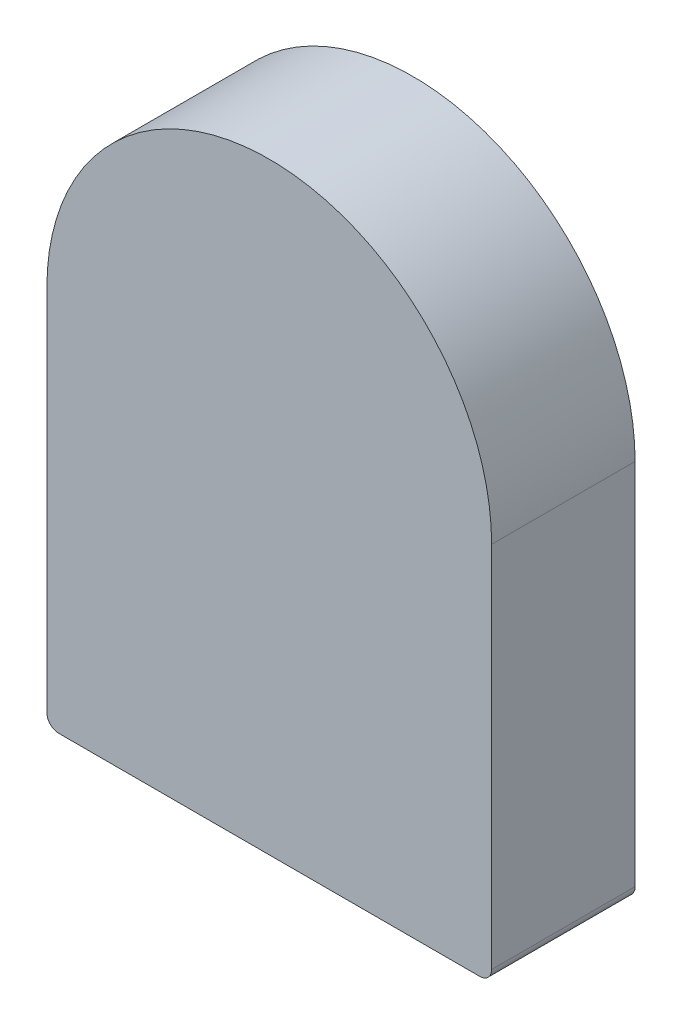
ISO-10303-21;
HEADER;
FILE_DESCRIPTION(('STEP AP214'),'2;1');
FILE_NAME('part.step','',(''),(''),'','','');
FILE_SCHEMA(('AUTOMOTIVE_DESIGN { 1 0 10303 214 1 1 1 1 }'));
ENDSEC;
DATA;
#1=APPLICATION_CONTEXT('core data for automotive mechanical design processes');
#2=APPLICATION_PROTOCOL_DEFINITION('international standard','automotive_design',2000,#1);
#3=PRODUCT_CONTEXT('',#1,'mechanical');
#4=PRODUCT('Part','Part','',(#3));
#5=PRODUCT_RELATED_PRODUCT_CATEGORY('part','',(#4));
#6=PRODUCT_DEFINITION_FORMATION('','',#4);
#7=PRODUCT_DEFINITION_CONTEXT('part definition',#1,'design');
#8=PRODUCT_DEFINITION('design','',#6,#7);
#9=PRODUCT_DEFINITION_SHAPE('','',#8);
#10=(LENGTH_UNIT() NAMED_UNIT(*) SI_UNIT(.MILLI.,.METRE.));
#11=(NAMED_UNIT(*) PLANE_ANGLE_UNIT() SI_UNIT($,.RADIAN.));
#12=(NAMED_UNIT(*) SI_UNIT($,.STERADIAN.) SOLID_ANGLE_UNIT());
#13=UNCERTAINTY_MEASURE_WITH_UNIT(LENGTH_MEASURE(1.E-05),#10,'distance_accuracy_value','');
#14=(GEOMETRIC_REPRESENTATION_CONTEXT(3) GLOBAL_UNCERTAINTY_ASSIGNED_CONTEXT((#13)) GLOBAL_UNIT_ASSIGNED_CONTEXT((#10,
#11,#12)) REPRESENTATION_CONTEXT('',''));
#15=CARTESIAN_POINT('',(0.,0.,0.));
#16=DIRECTION('',(0.,0.,1.));
#17=DIRECTION('',(1.,0.,0.));
#18=AXIS2_PLACEMENT_3D('',#15,#16,#17);
#19=CARTESIAN_POINT('',(0.,0.,6.));
#20=DIRECTION('',(0.,0.,-1.));
#21=DIRECTION('',(-1.,0.,0.));
#22=AXIS2_PLACEMENT_3D('',#19,#20,#21);
#23=CYLINDRICAL_SURFACE('',#22,9.3);
#24=CARTESIAN_POINT('',(0.,0.,0.));
#25=DIRECTION('',(0.,0.,1.));
#26=DIRECTION('',(1.,0.,0.));
#27=AXIS2_PLACEMENT_3D('',#24,#25,#26);
#28=CIRCLE('',#27,9.3);
#29=CARTESIAN_POINT('',(9.3,0.,0.));
#30=VERTEX_POINT('',#29);
#31=CARTESIAN_POINT('',(-9.3,0.,0.));
#32=VERTEX_POINT('',#31);
#33=EDGE_CURVE('E111',#30,#32,#28,.T.);
#34=ORIENTED_EDGE('',*,*,#33,.T.);
#35=DIRECTION('',(0.,0.,-1.));
#36=VECTOR('',#35,1.);
#37=CARTESIAN_POINT('',(-9.3,0.,6.));
#38=LINE('',#37,#36);
#39=CARTESIAN_POINT('',(-9.3,0.,6.));
#40=VERTEX_POINT('',#39);
#41=EDGE_CURVE('E94',#40,#32,#38,.T.);
#42=ORIENTED_EDGE('',*,*,#41,.F.);
#43=CARTESIAN_POINT('',(0.,0.,6.));
#44=DIRECTION('',(0.,0.,1.));
#45=DIRECTION('',(1.,0.,0.));
#46=AXIS2_PLACEMENT_3D('',#43,#44,#45);
#47=CIRCLE('',#46,9.3);
#48=CARTESIAN_POINT('',(9.3,0.,6.));
#49=VERTEX_POINT('',#48);
#50=EDGE_CURVE('E99',#49,#40,#47,.T.);
#51=ORIENTED_EDGE('',*,*,#50,.F.);
#52=DIRECTION('',(0.,0.,-1.));
#53=VECTOR('',#52,1.);
#54=CARTESIAN_POINT('',(9.3,0.,6.));
#55=LINE('',#54,#53);
#56=EDGE_CURVE('E113',#49,#30,#55,.T.);
#57=ORIENTED_EDGE('',*,*,#56,.T.);
#58=EDGE_LOOP('',(#34,#42,#51,#57));
#59=FACE_BOUND('',#58,.T.);
#60=ADVANCED_FACE('F38',(#59),#23,.T.);
#61=CARTESIAN_POINT('',(-9.3,0.,6.));
#62=DIRECTION('',(1.,0.,0.));
#63=DIRECTION('',(0.,1.,0.));
#64=AXIS2_PLACEMENT_3D('',#61,#62,#63);
#65=PLANE('',#64);
#66=DIRECTION('',(0.,-1.,0.));
#67=VECTOR('',#66,1.);
#68=CARTESIAN_POINT('',(-9.3,0.,0.));
#69=LINE('',#68,#67);
#70=CARTESIAN_POINT('',(-9.3,-15.4,0.));
#71=VERTEX_POINT('',#70);
#72=EDGE_CURVE('E143',#32,#71,#69,.T.);
#73=ORIENTED_EDGE('',*,*,#72,.T.);
#74=DIRECTION('',(0.,0.,-1.));
#75=VECTOR('',#74,1.);
#76=CARTESIAN_POINT('',(-9.3,-15.4,6.));
#77=LINE('',#76,#75);
#78=CARTESIAN_POINT('',(-9.3,-15.4,6.));
#79=VERTEX_POINT('',#78);
#80=EDGE_CURVE('E11',#71,#79,#77,.F.);
#81=ORIENTED_EDGE('',*,*,#80,.T.);
#82=DIRECTION('',(0.,-1.,0.));
#83=VECTOR('',#82,1.);
#84=CARTESIAN_POINT('',(-9.3,0.,6.));
#85=LINE('',#84,#83);
#86=EDGE_CURVE('E90',#40,#79,#85,.T.);
#87=ORIENTED_EDGE('',*,*,#86,.F.);
#88=ORIENTED_EDGE('',*,*,#41,.T.);
#89=EDGE_LOOP('',(#73,#81,#87,#88));
#90=FACE_BOUND('',#89,.T.);
#91=ADVANCED_FACE('F92',(#90),#65,.F.);
#92=CARTESIAN_POINT('',(-9.3,-15.9,6.));
#93=DIRECTION('',(0.,1.,0.));
#94=DIRECTION('',(0.,0.,1.));
#95=AXIS2_PLACEMENT_3D('',#92,#93,#94);
#96=PLANE('',#95);
#97=DIRECTION('',(1.,0.,0.));
#98=VECTOR('',#97,1.);
#99=CARTESIAN_POINT('',(-9.3,-15.9,0.));
#100=LINE('',#99,#98);
#101=CARTESIAN_POINT('',(-8.8,-15.9,0.));
#102=VERTEX_POINT('',#101);
#103=CARTESIAN_POINT('',(8.8,-15.9,0.));
#104=VERTEX_POINT('',#103);
#105=EDGE_CURVE('E140',#102,#104,#100,.T.);
#106=ORIENTED_EDGE('',*,*,#105,.T.);
#107=DIRECTION('',(0.,0.,-1.));
#108=VECTOR('',#107,1.);
#109=CARTESIAN_POINT('',(8.8,-15.9,6.));
#110=LINE('',#109,#108);
#111=CARTESIAN_POINT('',(8.8,-15.9,6.));
#112=VERTEX_POINT('',#111);
#113=EDGE_CURVE('E59',#104,#112,#110,.F.);
#114=ORIENTED_EDGE('',*,*,#113,.T.);
#115=DIRECTION('',(1.,0.,0.));
#116=VECTOR('',#115,1.);
#117=CARTESIAN_POINT('',(-9.3,-15.9,6.));
#118=LINE('',#117,#116);
#119=CARTESIAN_POINT('',(-8.8,-15.9,6.));
#120=VERTEX_POINT('',#119);
#121=EDGE_CURVE('E98',#120,#112,#118,.T.);
#122=ORIENTED_EDGE('',*,*,#121,.F.);
#123=DIRECTION('',(0.,0.,-1.));
#124=VECTOR('',#123,1.);
#125=CARTESIAN_POINT('',(-8.8,-15.9,6.));
#126=LINE('',#125,#124);
#127=EDGE_CURVE('E124',#120,#102,#126,.T.);
#128=ORIENTED_EDGE('',*,*,#127,.T.);
#129=EDGE_LOOP('',(#106,#114,#122,#128));
#130=FACE_BOUND('',#129,.T.);
#131=ADVANCED_FACE('F141',(#130),#96,.F.);
#132=CARTESIAN_POINT('',(9.3,0.,6.));
#133=DIRECTION('',(-1.,0.,0.));
#134=DIRECTION('',(0.,-1.,0.));
#135=AXIS2_PLACEMENT_3D('',#132,#133,#134);
#136=PLANE('',#135);
#137=DIRECTION('',(0.,1.,0.));
#138=VECTOR('',#137,1.);
#139=CARTESIAN_POINT('',(9.3,0.,6.));
#140=LINE('',#139,#138);
#141=CARTESIAN_POINT('',(9.3,-15.4,6.));
#142=VERTEX_POINT('',#141);
#143=EDGE_CURVE('E104',#142,#49,#140,.T.);
#144=ORIENTED_EDGE('',*,*,#143,.F.);
#145=DIRECTION('',(0.,0.,-1.));
#146=VECTOR('',#145,1.);
#147=CARTESIAN_POINT('',(9.3,-15.4,6.));
#148=LINE('',#147,#146);
#149=CARTESIAN_POINT('',(9.3,-15.4,0.));
#150=VERTEX_POINT('',#149);
#151=EDGE_CURVE('E112',#142,#150,#148,.T.);
#152=ORIENTED_EDGE('',*,*,#151,.T.);
#153=DIRECTION('',(0.,1.,0.));
#154=VECTOR('',#153,1.);
#155=CARTESIAN_POINT('',(9.3,0.,0.));
#156=LINE('',#155,#154);
#157=EDGE_CURVE('E108',#150,#30,#156,.T.);
#158=ORIENTED_EDGE('',*,*,#157,.T.);
#159=ORIENTED_EDGE('',*,*,#56,.F.);
#160=EDGE_LOOP('',(#144,#152,#158,#159));
#161=FACE_BOUND('',#160,.T.);
#162=ADVANCED_FACE('F133',(#161),#136,.F.);
#163=CARTESIAN_POINT('',(0.,0.,6.));
#164=DIRECTION('',(0.,0.,1.));
#165=DIRECTION('',(1.,0.,0.));
#166=AXIS2_PLACEMENT_3D('',#163,#164,#165);
#167=PLANE('',#166);
#168=ORIENTED_EDGE('',*,*,#121,.T.);
#169=CARTESIAN_POINT('',(8.8,-15.4,6.));
#170=DIRECTION('',(0.,0.,1.));
#171=DIRECTION('',(1.,0.,0.));
#172=AXIS2_PLACEMENT_3D('',#169,#170,#171);
#173=CIRCLE('',#172,0.5);
#174=EDGE_CURVE('E46',#112,#142,#173,.T.);
#175=ORIENTED_EDGE('',*,*,#174,.T.);
#176=ORIENTED_EDGE('',*,*,#143,.T.);
#177=ORIENTED_EDGE('',*,*,#50,.T.);
#178=ORIENTED_EDGE('',*,*,#86,.T.);
#179=CARTESIAN_POINT('',(-8.8,-15.4,6.));
#180=DIRECTION('',(0.,0.,1.));
#181=DIRECTION('',(1.,0.,0.));
#182=AXIS2_PLACEMENT_3D('',#179,#180,#181);
#183=CIRCLE('',#182,0.5);
#184=EDGE_CURVE('E128',#79,#120,#183,.T.);
#185=ORIENTED_EDGE('',*,*,#184,.T.);
#186=EDGE_LOOP('',(#168,#175,#176,#177,#178,#185));
#187=FACE_BOUND('',#186,.T.);
#188=ADVANCED_FACE('F102',(#187),#167,.T.);
#189=CARTESIAN_POINT('',(0.,0.,0.));
#190=DIRECTION('',(0.,0.,1.));
#191=DIRECTION('',(1.,0.,0.));
#192=AXIS2_PLACEMENT_3D('',#189,#190,#191);
#193=PLANE('',#192);
#194=ORIENTED_EDGE('',*,*,#157,.F.);
#195=CARTESIAN_POINT('',(8.8,-15.4,0.));
#196=DIRECTION('',(0.,0.,1.));
#197=DIRECTION('',(1.,0.,0.));
#198=AXIS2_PLACEMENT_3D('',#195,#196,#197);
#199=CIRCLE('',#198,0.5);
#200=EDGE_CURVE('E122',#150,#104,#199,.F.);
#201=ORIENTED_EDGE('',*,*,#200,.T.);
#202=ORIENTED_EDGE('',*,*,#105,.F.);
#203=CARTESIAN_POINT('',(-8.8,-15.4,0.));
#204=DIRECTION('',(0.,0.,1.));
#205=DIRECTION('',(1.,0.,0.));
#206=AXIS2_PLACEMENT_3D('',#203,#204,#205);
#207=CIRCLE('',#206,0.5);
#208=EDGE_CURVE('E116',#102,#71,#207,.F.);
#209=ORIENTED_EDGE('',*,*,#208,.T.);
#210=ORIENTED_EDGE('',*,*,#72,.F.);
#211=ORIENTED_EDGE('',*,*,#33,.F.);
#212=EDGE_LOOP('',(#194,#201,#202,#209,#210,#211));
#213=FACE_BOUND('',#212,.T.);
#214=ADVANCED_FACE('F139',(#213),#193,.F.);
#215=CARTESIAN_POINT('',(8.8,-15.4,6.));
#216=DIRECTION('',(0.,0.,-1.));
#217=DIRECTION('',(-1.,0.,0.));
#218=AXIS2_PLACEMENT_3D('',#215,#216,#217);
#219=CYLINDRICAL_SURFACE('',#218,0.5);
#220=ORIENTED_EDGE('',*,*,#174,.F.);
#221=ORIENTED_EDGE('',*,*,#113,.F.);
#222=ORIENTED_EDGE('',*,*,#200,.F.);
#223=ORIENTED_EDGE('',*,*,#151,.F.);
#224=EDGE_LOOP('',(#220,#221,#222,#223));
#225=FACE_BOUND('',#224,.T.);
#226=ADVANCED_FACE('F136',(#225),#219,.T.);
#227=CARTESIAN_POINT('',(-8.8,-15.4,6.));
#228=DIRECTION('',(0.,0.,-1.));
#229=DIRECTION('',(-1.,0.,0.));
#230=AXIS2_PLACEMENT_3D('',#227,#228,#229);
#231=CYLINDRICAL_SURFACE('',#230,0.5);
#232=ORIENTED_EDGE('',*,*,#184,.F.);
#233=ORIENTED_EDGE('',*,*,#80,.F.);
#234=ORIENTED_EDGE('',*,*,#208,.F.);
#235=ORIENTED_EDGE('',*,*,#127,.F.);
#236=EDGE_LOOP('',(#232,#233,#234,#235));
#237=FACE_BOUND('',#236,.T.);
#238=ADVANCED_FACE('F40',(#237),#231,.T.);
#239=CLOSED_SHELL('',(#60,#91,#131,#162,#188,#214,#226,#238));
#240=MANIFOLD_SOLID_BREP('B2',#239);
#241=ADVANCED_BREP_SHAPE_REPRESENTATION('',(#18,#240),#14);
#242=SHAPE_DEFINITION_REPRESENTATION(#9,#241);
ENDSEC;
END-ISO-10303-21;
